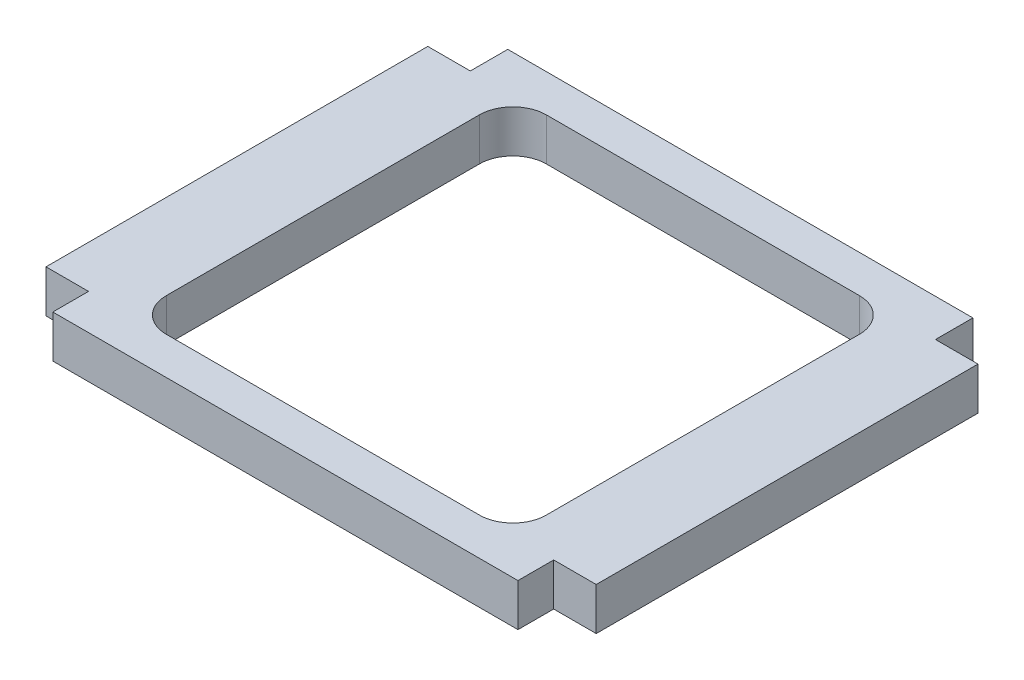
ISO-10303-21;
HEADER;
FILE_DESCRIPTION(('STEP AP214'),'2;1');
FILE_NAME('part.step','',(''),(''),'','','');
FILE_SCHEMA(('AUTOMOTIVE_DESIGN { 1 0 10303 214 1 1 1 1 }'));
ENDSEC;
DATA;
#1=APPLICATION_CONTEXT('core data for automotive mechanical design processes');
#2=APPLICATION_PROTOCOL_DEFINITION('international standard','automotive_design',2000,#1);
#3=PRODUCT_CONTEXT('',#1,'mechanical');
#4=PRODUCT('Part','Part','',(#3));
#5=PRODUCT_RELATED_PRODUCT_CATEGORY('part','',(#4));
#6=PRODUCT_DEFINITION_FORMATION('','',#4);
#7=PRODUCT_DEFINITION_CONTEXT('part definition',#1,'design');
#8=PRODUCT_DEFINITION('design','',#6,#7);
#9=PRODUCT_DEFINITION_SHAPE('','',#8);
#10=(LENGTH_UNIT() NAMED_UNIT(*) SI_UNIT(.MILLI.,.METRE.));
#11=(NAMED_UNIT(*) PLANE_ANGLE_UNIT() SI_UNIT($,.RADIAN.));
#12=(NAMED_UNIT(*) SI_UNIT($,.STERADIAN.) SOLID_ANGLE_UNIT());
#13=UNCERTAINTY_MEASURE_WITH_UNIT(LENGTH_MEASURE(1.E-05),#10,'distance_accuracy_value','');
#14=(GEOMETRIC_REPRESENTATION_CONTEXT(3) GLOBAL_UNCERTAINTY_ASSIGNED_CONTEXT((#13)) GLOBAL_UNIT_ASSIGNED_CONTEXT((#10,
#11,#12)) REPRESENTATION_CONTEXT('',''));
#15=CARTESIAN_POINT('',(0.,0.,0.));
#16=DIRECTION('',(0.,0.,1.));
#17=DIRECTION('',(1.,0.,0.));
#18=AXIS2_PLACEMENT_3D('',#15,#16,#17);
#19=CARTESIAN_POINT('',(0.,6.35,0.));
#20=DIRECTION('',(0.,-1.,0.));
#21=DIRECTION('',(0.,0.,-1.));
#22=AXIS2_PLACEMENT_3D('',#19,#20,#21);
#23=PLANE('',#22);
#24=DIRECTION('',(0.,0.,1.));
#25=VECTOR('',#24,1.);
#26=CARTESIAN_POINT('',(-34.7218,6.35,33.9598));
#27=LINE('',#26,#25);
#28=CARTESIAN_POINT('',(-34.7218,6.35,28.6282));
#29=VERTEX_POINT('',#28);
#30=CARTESIAN_POINT('',(-34.7218,6.35,33.9598));
#31=VERTEX_POINT('',#30);
#32=EDGE_CURVE('E234',#29,#31,#27,.T.);
#33=ORIENTED_EDGE('',*,*,#32,.T.);
#34=DIRECTION('',(1.,0.,0.));
#35=VECTOR('',#34,1.);
#36=CARTESIAN_POINT('',(-34.7218,6.35,33.9598));
#37=LINE('',#36,#35);
#38=CARTESIAN_POINT('',(34.7218,6.35,33.9598));
#39=VERTEX_POINT('',#38);
#40=EDGE_CURVE('E237',#31,#39,#37,.T.);
#41=ORIENTED_EDGE('',*,*,#40,.T.);
#42=DIRECTION('',(0.,0.,-1.));
#43=VECTOR('',#42,1.);
#44=CARTESIAN_POINT('',(34.7218,6.35,33.9598));
#45=LINE('',#44,#43);
#46=CARTESIAN_POINT('',(34.7218,6.35,28.6282));
#47=VERTEX_POINT('',#46);
#48=EDGE_CURVE('E240',#39,#47,#45,.T.);
#49=ORIENTED_EDGE('',*,*,#48,.T.);
#50=DIRECTION('',(1.,0.,0.));
#51=VECTOR('',#50,1.);
#52=CARTESIAN_POINT('',(41.0718,6.35,28.6282));
#53=LINE('',#52,#51);
#54=CARTESIAN_POINT('',(41.0718,6.35,28.6282));
#55=VERTEX_POINT('',#54);
#56=EDGE_CURVE('E242',#47,#55,#53,.T.);
#57=ORIENTED_EDGE('',*,*,#56,.T.);
#58=DIRECTION('',(0.,0.,-1.));
#59=VECTOR('',#58,1.);
#60=CARTESIAN_POINT('',(41.0718,6.35,28.6282));
#61=LINE('',#60,#59);
#62=CARTESIAN_POINT('',(41.0718,6.35,-28.3718));
#63=VERTEX_POINT('',#62);
#64=EDGE_CURVE('E244',#55,#63,#61,.T.);
#65=ORIENTED_EDGE('',*,*,#64,.T.);
#66=DIRECTION('',(-1.,0.,0.));
#67=VECTOR('',#66,1.);
#68=CARTESIAN_POINT('',(34.7218,6.35,-28.3718));
#69=LINE('',#68,#67);
#70=CARTESIAN_POINT('',(34.7218,6.35,-28.3718));
#71=VERTEX_POINT('',#70);
#72=EDGE_CURVE('E246',#63,#71,#69,.T.);
#73=ORIENTED_EDGE('',*,*,#72,.T.);
#74=DIRECTION('',(0.,0.,-1.));
#75=VECTOR('',#74,1.);
#76=CARTESIAN_POINT('',(34.7218,6.35,-28.3718));
#77=LINE('',#76,#75);
#78=CARTESIAN_POINT('',(34.7218,6.35,-33.9598));
#79=VERTEX_POINT('',#78);
#80=EDGE_CURVE('E248',#71,#79,#77,.T.);
#81=ORIENTED_EDGE('',*,*,#80,.T.);
#82=DIRECTION('',(-1.,0.,0.));
#83=VECTOR('',#82,1.);
#84=CARTESIAN_POINT('',(-34.7218,6.35,-33.9598));
#85=LINE('',#84,#83);
#86=CARTESIAN_POINT('',(-34.7218,6.35,-33.9598));
#87=VERTEX_POINT('',#86);
#88=EDGE_CURVE('E250',#79,#87,#85,.T.);
#89=ORIENTED_EDGE('',*,*,#88,.T.);
#90=DIRECTION('',(0.,0.,1.));
#91=VECTOR('',#90,1.);
#92=CARTESIAN_POINT('',(-34.7218,6.35,-28.3718));
#93=LINE('',#92,#91);
#94=CARTESIAN_POINT('',(-34.7218,6.35,-28.3718));
#95=VERTEX_POINT('',#94);
#96=EDGE_CURVE('E252',#87,#95,#93,.T.);
#97=ORIENTED_EDGE('',*,*,#96,.T.);
#98=DIRECTION('',(-1.,0.,0.));
#99=VECTOR('',#98,1.);
#100=CARTESIAN_POINT('',(-41.0718,6.35,-28.3718));
#101=LINE('',#100,#99);
#102=CARTESIAN_POINT('',(-41.0718,6.35,-28.3718));
#103=VERTEX_POINT('',#102);
#104=EDGE_CURVE('E254',#95,#103,#101,.T.);
#105=ORIENTED_EDGE('',*,*,#104,.T.);
#106=DIRECTION('',(0.,0.,1.));
#107=VECTOR('',#106,1.);
#108=CARTESIAN_POINT('',(-41.0718,6.35,28.6282));
#109=LINE('',#108,#107);
#110=CARTESIAN_POINT('',(-41.0718,6.35,28.6282));
#111=VERTEX_POINT('',#110);
#112=EDGE_CURVE('E256',#103,#111,#109,.T.);
#113=ORIENTED_EDGE('',*,*,#112,.T.);
#114=DIRECTION('',(1.,0.,0.));
#115=VECTOR('',#114,1.);
#116=CARTESIAN_POINT('',(-41.0718,6.35,28.6282));
#117=LINE('',#116,#115);
#118=EDGE_CURVE('E258',#111,#29,#117,.T.);
#119=ORIENTED_EDGE('',*,*,#118,.T.);
#120=EDGE_LOOP('',(#33,#41,#49,#57,#65,#73,#81,#89,#97,#105,#113,#119));
#121=FACE_BOUND('',#120,.T.);
#122=CARTESIAN_POINT('',(23.3718,6.35,-23.3718));
#123=DIRECTION('',(0.,1.,0.));
#124=DIRECTION('',(0.,0.,1.));
#125=AXIS2_PLACEMENT_3D('',#122,#123,#124);
#126=CIRCLE('',#125,5.);
#127=CARTESIAN_POINT('',(28.3718,6.35,-23.3718));
#128=VERTEX_POINT('',#127);
#129=CARTESIAN_POINT('',(23.3718,6.35,-28.3718));
#130=VERTEX_POINT('',#129);
#131=EDGE_CURVE('E169',#128,#130,#126,.T.);
#132=ORIENTED_EDGE('',*,*,#131,.F.);
#133=DIRECTION('',(0.,0.,-1.));
#134=VECTOR('',#133,1.);
#135=CARTESIAN_POINT('',(28.3718,6.35,23.3718));
#136=LINE('',#135,#134);
#137=CARTESIAN_POINT('',(28.3718,6.35,23.3718));
#138=VERTEX_POINT('',#137);
#139=EDGE_CURVE('E202',#138,#128,#136,.T.);
#140=ORIENTED_EDGE('',*,*,#139,.F.);
#141=CARTESIAN_POINT('',(23.3718,6.35,23.3718));
#142=DIRECTION('',(0.,1.,0.));
#143=DIRECTION('',(0.,0.,-1.));
#144=AXIS2_PLACEMENT_3D('',#141,#142,#143);
#145=CIRCLE('',#144,5.);
#146=CARTESIAN_POINT('',(23.3718,6.35,28.3718));
#147=VERTEX_POINT('',#146);
#148=EDGE_CURVE('E200',#147,#138,#145,.T.);
#149=ORIENTED_EDGE('',*,*,#148,.F.);
#150=DIRECTION('',(1.,0.,0.));
#151=VECTOR('',#150,1.);
#152=CARTESIAN_POINT('',(-23.3718,6.35,28.3718));
#153=LINE('',#152,#151);
#154=CARTESIAN_POINT('',(-23.3718,6.35,28.3718));
#155=VERTEX_POINT('',#154);
#156=EDGE_CURVE('E198',#155,#147,#153,.T.);
#157=ORIENTED_EDGE('',*,*,#156,.F.);
#158=CARTESIAN_POINT('',(-23.3718,6.35,23.3718));
#159=DIRECTION('',(0.,1.,0.));
#160=DIRECTION('',(0.,0.,-1.));
#161=AXIS2_PLACEMENT_3D('',#158,#159,#160);
#162=CIRCLE('',#161,5.);
#163=CARTESIAN_POINT('',(-28.3718,6.35,23.3718));
#164=VERTEX_POINT('',#163);
#165=EDGE_CURVE('E196',#164,#155,#162,.T.);
#166=ORIENTED_EDGE('',*,*,#165,.F.);
#167=DIRECTION('',(0.,0.,1.));
#168=VECTOR('',#167,1.);
#169=CARTESIAN_POINT('',(-28.3718,6.35,23.3718));
#170=LINE('',#169,#168);
#171=CARTESIAN_POINT('',(-28.3718,6.35,-23.3718));
#172=VERTEX_POINT('',#171);
#173=EDGE_CURVE('E192',#172,#164,#170,.T.);
#174=ORIENTED_EDGE('',*,*,#173,.F.);
#175=CARTESIAN_POINT('',(-23.3718,6.35,-23.3718));
#176=DIRECTION('',(0.,1.,0.));
#177=DIRECTION('',(0.,0.,-1.));
#178=AXIS2_PLACEMENT_3D('',#175,#176,#177);
#179=CIRCLE('',#178,5.);
#180=CARTESIAN_POINT('',(-23.3718,6.35,-28.3718));
#181=VERTEX_POINT('',#180);
#182=EDGE_CURVE('E190',#181,#172,#179,.T.);
#183=ORIENTED_EDGE('',*,*,#182,.F.);
#184=DIRECTION('',(-1.,0.,0.));
#185=VECTOR('',#184,1.);
#186=CARTESIAN_POINT('',(-23.3718,6.35,-28.3718));
#187=LINE('',#186,#185);
#188=EDGE_CURVE('E177',#130,#181,#187,.T.);
#189=ORIENTED_EDGE('',*,*,#188,.F.);
#190=EDGE_LOOP('',(#132,#140,#149,#157,#166,#174,#183,#189));
#191=FACE_BOUND('',#190,.T.);
#192=ADVANCED_FACE('F32',(#121,#191),#23,.F.);
#193=CARTESIAN_POINT('',(0.,0.,0.));
#194=DIRECTION('',(0.,-1.,0.));
#195=DIRECTION('',(0.,0.,-1.));
#196=AXIS2_PLACEMENT_3D('',#193,#194,#195);
#197=PLANE('',#196);
#198=DIRECTION('',(0.,0.,1.));
#199=VECTOR('',#198,1.);
#200=CARTESIAN_POINT('',(-34.7218,0.,33.9598));
#201=LINE('',#200,#199);
#202=CARTESIAN_POINT('',(-34.7218,0.,28.6282));
#203=VERTEX_POINT('',#202);
#204=CARTESIAN_POINT('',(-34.7218,0.,33.9598));
#205=VERTEX_POINT('',#204);
#206=EDGE_CURVE('E185',#203,#205,#201,.T.);
#207=ORIENTED_EDGE('',*,*,#206,.F.);
#208=DIRECTION('',(1.,0.,0.));
#209=VECTOR('',#208,1.);
#210=CARTESIAN_POINT('',(-41.0718,0.,28.6282));
#211=LINE('',#210,#209);
#212=CARTESIAN_POINT('',(-41.0718,0.,28.6282));
#213=VERTEX_POINT('',#212);
#214=EDGE_CURVE('E238',#213,#203,#211,.T.);
#215=ORIENTED_EDGE('',*,*,#214,.F.);
#216=DIRECTION('',(0.,0.,1.));
#217=VECTOR('',#216,1.);
#218=CARTESIAN_POINT('',(-41.0718,0.,28.6282));
#219=LINE('',#218,#217);
#220=CARTESIAN_POINT('',(-41.0718,0.,-28.3718));
#221=VERTEX_POINT('',#220);
#222=EDGE_CURVE('E281',#221,#213,#219,.T.);
#223=ORIENTED_EDGE('',*,*,#222,.F.);
#224=DIRECTION('',(-1.,0.,0.));
#225=VECTOR('',#224,1.);
#226=CARTESIAN_POINT('',(-41.0718,0.,-28.3718));
#227=LINE('',#226,#225);
#228=CARTESIAN_POINT('',(-34.7218,0.,-28.3718));
#229=VERTEX_POINT('',#228);
#230=EDGE_CURVE('E279',#229,#221,#227,.T.);
#231=ORIENTED_EDGE('',*,*,#230,.F.);
#232=DIRECTION('',(0.,0.,1.));
#233=VECTOR('',#232,1.);
#234=CARTESIAN_POINT('',(-34.7218,0.,-28.3718));
#235=LINE('',#234,#233);
#236=CARTESIAN_POINT('',(-34.7218,0.,-33.9598));
#237=VERTEX_POINT('',#236);
#238=EDGE_CURVE('E277',#237,#229,#235,.T.);
#239=ORIENTED_EDGE('',*,*,#238,.F.);
#240=DIRECTION('',(-1.,0.,0.));
#241=VECTOR('',#240,1.);
#242=CARTESIAN_POINT('',(-34.7218,0.,-33.9598));
#243=LINE('',#242,#241);
#244=CARTESIAN_POINT('',(34.7218,0.,-33.9598));
#245=VERTEX_POINT('',#244);
#246=EDGE_CURVE('E275',#245,#237,#243,.T.);
#247=ORIENTED_EDGE('',*,*,#246,.F.);
#248=DIRECTION('',(0.,0.,-1.));
#249=VECTOR('',#248,1.);
#250=CARTESIAN_POINT('',(34.7218,0.,-28.3718));
#251=LINE('',#250,#249);
#252=CARTESIAN_POINT('',(34.7218,0.,-28.3718));
#253=VERTEX_POINT('',#252);
#254=EDGE_CURVE('E273',#253,#245,#251,.T.);
#255=ORIENTED_EDGE('',*,*,#254,.F.);
#256=DIRECTION('',(-1.,0.,0.));
#257=VECTOR('',#256,1.);
#258=CARTESIAN_POINT('',(34.7218,0.,-28.3718));
#259=LINE('',#258,#257);
#260=CARTESIAN_POINT('',(41.0718,0.,-28.3718));
#261=VERTEX_POINT('',#260);
#262=EDGE_CURVE('E271',#261,#253,#259,.T.);
#263=ORIENTED_EDGE('',*,*,#262,.F.);
#264=DIRECTION('',(0.,0.,-1.));
#265=VECTOR('',#264,1.);
#266=CARTESIAN_POINT('',(41.0718,0.,28.6282));
#267=LINE('',#266,#265);
#268=CARTESIAN_POINT('',(41.0718,0.,28.6282));
#269=VERTEX_POINT('',#268);
#270=EDGE_CURVE('E269',#269,#261,#267,.T.);
#271=ORIENTED_EDGE('',*,*,#270,.F.);
#272=DIRECTION('',(1.,0.,0.));
#273=VECTOR('',#272,1.);
#274=CARTESIAN_POINT('',(41.0718,0.,28.6282));
#275=LINE('',#274,#273);
#276=CARTESIAN_POINT('',(34.7218,0.,28.6282));
#277=VERTEX_POINT('',#276);
#278=EDGE_CURVE('E267',#277,#269,#275,.T.);
#279=ORIENTED_EDGE('',*,*,#278,.F.);
#280=DIRECTION('',(0.,0.,-1.));
#281=VECTOR('',#280,1.);
#282=CARTESIAN_POINT('',(34.7218,0.,33.9598));
#283=LINE('',#282,#281);
#284=CARTESIAN_POINT('',(34.7218,0.,33.9598));
#285=VERTEX_POINT('',#284);
#286=EDGE_CURVE('E265',#285,#277,#283,.T.);
#287=ORIENTED_EDGE('',*,*,#286,.F.);
#288=DIRECTION('',(1.,0.,0.));
#289=VECTOR('',#288,1.);
#290=CARTESIAN_POINT('',(-34.7218,0.,33.9598));
#291=LINE('',#290,#289);
#292=EDGE_CURVE('E263',#205,#285,#291,.T.);
#293=ORIENTED_EDGE('',*,*,#292,.F.);
#294=EDGE_LOOP('',(#207,#215,#223,#231,#239,#247,#255,#263,#271,#279,#287,#293));
#295=FACE_BOUND('',#294,.T.);
#296=DIRECTION('',(0.,0.,-1.));
#297=VECTOR('',#296,1.);
#298=CARTESIAN_POINT('',(28.3718,0.,23.3718));
#299=LINE('',#298,#297);
#300=CARTESIAN_POINT('',(28.3718,0.,23.3718));
#301=VERTEX_POINT('',#300);
#302=CARTESIAN_POINT('',(28.3718,0.,-23.3718));
#303=VERTEX_POINT('',#302);
#304=EDGE_CURVE('E178',#301,#303,#299,.T.);
#305=ORIENTED_EDGE('',*,*,#304,.T.);
#306=CARTESIAN_POINT('',(23.3718,0.,-23.3718));
#307=DIRECTION('',(0.,1.,0.));
#308=DIRECTION('',(0.,0.,1.));
#309=AXIS2_PLACEMENT_3D('',#306,#307,#308);
#310=CIRCLE('',#309,5.);
#311=CARTESIAN_POINT('',(23.3718,0.,-28.3718));
#312=VERTEX_POINT('',#311);
#313=EDGE_CURVE('E55',#303,#312,#310,.T.);
#314=ORIENTED_EDGE('',*,*,#313,.T.);
#315=DIRECTION('',(-1.,0.,0.));
#316=VECTOR('',#315,1.);
#317=CARTESIAN_POINT('',(-23.3718,0.,-28.3718));
#318=LINE('',#317,#316);
#319=CARTESIAN_POINT('',(-23.3718,0.,-28.3718));
#320=VERTEX_POINT('',#319);
#321=EDGE_CURVE('E184',#312,#320,#318,.T.);
#322=ORIENTED_EDGE('',*,*,#321,.T.);
#323=CARTESIAN_POINT('',(-23.3718,0.,-23.3718));
#324=DIRECTION('',(0.,1.,0.));
#325=DIRECTION('',(0.,0.,-1.));
#326=AXIS2_PLACEMENT_3D('',#323,#324,#325);
#327=CIRCLE('',#326,5.);
#328=CARTESIAN_POINT('',(-28.3718,0.,-23.3718));
#329=VERTEX_POINT('',#328);
#330=EDGE_CURVE('E206',#320,#329,#327,.T.);
#331=ORIENTED_EDGE('',*,*,#330,.T.);
#332=DIRECTION('',(0.,0.,1.));
#333=VECTOR('',#332,1.);
#334=CARTESIAN_POINT('',(-28.3718,0.,23.3718));
#335=LINE('',#334,#333);
#336=CARTESIAN_POINT('',(-28.3718,0.,23.3718));
#337=VERTEX_POINT('',#336);
#338=EDGE_CURVE('E209',#329,#337,#335,.T.);
#339=ORIENTED_EDGE('',*,*,#338,.T.);
#340=CARTESIAN_POINT('',(-23.3718,0.,23.3718));
#341=DIRECTION('',(0.,1.,0.));
#342=DIRECTION('',(0.,0.,-1.));
#343=AXIS2_PLACEMENT_3D('',#340,#341,#342);
#344=CIRCLE('',#343,5.);
#345=CARTESIAN_POINT('',(-23.3718,0.,28.3718));
#346=VERTEX_POINT('',#345);
#347=EDGE_CURVE('E212',#337,#346,#344,.T.);
#348=ORIENTED_EDGE('',*,*,#347,.T.);
#349=DIRECTION('',(1.,0.,0.));
#350=VECTOR('',#349,1.);
#351=CARTESIAN_POINT('',(-23.3718,0.,28.3718));
#352=LINE('',#351,#350);
#353=CARTESIAN_POINT('',(23.3718,0.,28.3718));
#354=VERTEX_POINT('',#353);
#355=EDGE_CURVE('E215',#346,#354,#352,.T.);
#356=ORIENTED_EDGE('',*,*,#355,.T.);
#357=CARTESIAN_POINT('',(23.3718,0.,23.3718));
#358=DIRECTION('',(0.,1.,0.));
#359=DIRECTION('',(0.,0.,-1.));
#360=AXIS2_PLACEMENT_3D('',#357,#358,#359);
#361=CIRCLE('',#360,5.);
#362=EDGE_CURVE('E218',#354,#301,#361,.T.);
#363=ORIENTED_EDGE('',*,*,#362,.T.);
#364=EDGE_LOOP('',(#305,#314,#322,#331,#339,#348,#356,#363));
#365=FACE_BOUND('',#364,.T.);
#366=ADVANCED_FACE('F323',(#295,#365),#197,.T.);
#367=CARTESIAN_POINT('',(-34.7218,6.35,33.9598));
#368=DIRECTION('',(1.,0.,0.));
#369=DIRECTION('',(0.,0.,-1.));
#370=AXIS2_PLACEMENT_3D('',#367,#368,#369);
#371=PLANE('',#370);
#372=ORIENTED_EDGE('',*,*,#206,.T.);
#373=DIRECTION('',(0.,-1.,0.));
#374=VECTOR('',#373,1.);
#375=CARTESIAN_POINT('',(-34.7218,6.35,33.9598));
#376=LINE('',#375,#374);
#377=EDGE_CURVE('E11',#31,#205,#376,.T.);
#378=ORIENTED_EDGE('',*,*,#377,.F.);
#379=ORIENTED_EDGE('',*,*,#32,.F.);
#380=DIRECTION('',(0.,-1.,0.));
#381=VECTOR('',#380,1.);
#382=CARTESIAN_POINT('',(-34.7218,6.35,28.6282));
#383=LINE('',#382,#381);
#384=EDGE_CURVE('E260',#29,#203,#383,.T.);
#385=ORIENTED_EDGE('',*,*,#384,.T.);
#386=EDGE_LOOP('',(#372,#378,#379,#385));
#387=FACE_BOUND('',#386,.T.);
#388=ADVANCED_FACE('F34',(#387),#371,.F.);
#389=CARTESIAN_POINT('',(-34.7218,6.35,33.9598));
#390=DIRECTION('',(0.,0.,-1.));
#391=DIRECTION('',(-1.,0.,0.));
#392=AXIS2_PLACEMENT_3D('',#389,#390,#391);
#393=PLANE('',#392);
#394=ORIENTED_EDGE('',*,*,#292,.T.);
#395=DIRECTION('',(0.,-1.,0.));
#396=VECTOR('',#395,1.);
#397=CARTESIAN_POINT('',(34.7218,6.35,33.9598));
#398=LINE('',#397,#396);
#399=EDGE_CURVE('E40',#39,#285,#398,.T.);
#400=ORIENTED_EDGE('',*,*,#399,.F.);
#401=ORIENTED_EDGE('',*,*,#40,.F.);
#402=ORIENTED_EDGE('',*,*,#377,.T.);
#403=EDGE_LOOP('',(#394,#400,#401,#402));
#404=FACE_BOUND('',#403,.T.);
#405=ADVANCED_FACE('F340',(#404),#393,.F.);
#406=CARTESIAN_POINT('',(34.7218,6.35,33.9598));
#407=DIRECTION('',(-1.,0.,0.));
#408=DIRECTION('',(0.,0.,1.));
#409=AXIS2_PLACEMENT_3D('',#406,#407,#408);
#410=PLANE('',#409);
#411=ORIENTED_EDGE('',*,*,#286,.T.);
#412=DIRECTION('',(0.,-1.,0.));
#413=VECTOR('',#412,1.);
#414=CARTESIAN_POINT('',(34.7218,6.35,28.6282));
#415=LINE('',#414,#413);
#416=EDGE_CURVE('E310',#47,#277,#415,.T.);
#417=ORIENTED_EDGE('',*,*,#416,.F.);
#418=ORIENTED_EDGE('',*,*,#48,.F.);
#419=ORIENTED_EDGE('',*,*,#399,.T.);
#420=EDGE_LOOP('',(#411,#417,#418,#419));
#421=FACE_BOUND('',#420,.T.);
#422=ADVANCED_FACE('F317',(#421),#410,.F.);
#423=CARTESIAN_POINT('',(41.0718,6.35,28.6282));
#424=DIRECTION('',(0.,0.,-1.));
#425=DIRECTION('',(-1.,0.,0.));
#426=AXIS2_PLACEMENT_3D('',#423,#424,#425);
#427=PLANE('',#426);
#428=ORIENTED_EDGE('',*,*,#278,.T.);
#429=DIRECTION('',(0.,-1.,0.));
#430=VECTOR('',#429,1.);
#431=CARTESIAN_POINT('',(41.0718,6.35,28.6282));
#432=LINE('',#431,#430);
#433=EDGE_CURVE('E307',#55,#269,#432,.T.);
#434=ORIENTED_EDGE('',*,*,#433,.F.);
#435=ORIENTED_EDGE('',*,*,#56,.F.);
#436=ORIENTED_EDGE('',*,*,#416,.T.);
#437=EDGE_LOOP('',(#428,#434,#435,#436));
#438=FACE_BOUND('',#437,.T.);
#439=ADVANCED_FACE('F329',(#438),#427,.F.);
#440=CARTESIAN_POINT('',(41.0718,6.35,28.6282));
#441=DIRECTION('',(-1.,0.,0.));
#442=DIRECTION('',(0.,0.,1.));
#443=AXIS2_PLACEMENT_3D('',#440,#441,#442);
#444=PLANE('',#443);
#445=ORIENTED_EDGE('',*,*,#270,.T.);
#446=DIRECTION('',(0.,-1.,0.));
#447=VECTOR('',#446,1.);
#448=CARTESIAN_POINT('',(41.0718,6.35,-28.3718));
#449=LINE('',#448,#447);
#450=EDGE_CURVE('E304',#63,#261,#449,.T.);
#451=ORIENTED_EDGE('',*,*,#450,.F.);
#452=ORIENTED_EDGE('',*,*,#64,.F.);
#453=ORIENTED_EDGE('',*,*,#433,.T.);
#454=EDGE_LOOP('',(#445,#451,#452,#453));
#455=FACE_BOUND('',#454,.T.);
#456=ADVANCED_FACE('F333',(#455),#444,.F.);
#457=CARTESIAN_POINT('',(34.7218,6.35,-28.3718));
#458=DIRECTION('',(0.,0.,1.));
#459=DIRECTION('',(1.,0.,0.));
#460=AXIS2_PLACEMENT_3D('',#457,#458,#459);
#461=PLANE('',#460);
#462=ORIENTED_EDGE('',*,*,#262,.T.);
#463=DIRECTION('',(0.,-1.,0.));
#464=VECTOR('',#463,1.);
#465=CARTESIAN_POINT('',(34.7218,6.35,-28.3718));
#466=LINE('',#465,#464);
#467=EDGE_CURVE('E301',#71,#253,#466,.T.);
#468=ORIENTED_EDGE('',*,*,#467,.F.);
#469=ORIENTED_EDGE('',*,*,#72,.F.);
#470=ORIENTED_EDGE('',*,*,#450,.T.);
#471=EDGE_LOOP('',(#462,#468,#469,#470));
#472=FACE_BOUND('',#471,.T.);
#473=ADVANCED_FACE('F373',(#472),#461,.F.);
#474=CARTESIAN_POINT('',(34.7218,6.35,-28.3718));
#475=DIRECTION('',(-1.,0.,0.));
#476=DIRECTION('',(0.,0.,1.));
#477=AXIS2_PLACEMENT_3D('',#474,#475,#476);
#478=PLANE('',#477);
#479=ORIENTED_EDGE('',*,*,#254,.T.);
#480=DIRECTION('',(0.,-1.,0.));
#481=VECTOR('',#480,1.);
#482=CARTESIAN_POINT('',(34.7218,6.35,-33.9598));
#483=LINE('',#482,#481);
#484=EDGE_CURVE('E298',#79,#245,#483,.T.);
#485=ORIENTED_EDGE('',*,*,#484,.F.);
#486=ORIENTED_EDGE('',*,*,#80,.F.);
#487=ORIENTED_EDGE('',*,*,#467,.T.);
#488=EDGE_LOOP('',(#479,#485,#486,#487));
#489=FACE_BOUND('',#488,.T.);
#490=ADVANCED_FACE('F371',(#489),#478,.F.);
#491=CARTESIAN_POINT('',(-34.7218,6.35,-33.9598));
#492=DIRECTION('',(0.,0.,1.));
#493=DIRECTION('',(1.,0.,0.));
#494=AXIS2_PLACEMENT_3D('',#491,#492,#493);
#495=PLANE('',#494);
#496=ORIENTED_EDGE('',*,*,#246,.T.);
#497=DIRECTION('',(0.,-1.,0.));
#498=VECTOR('',#497,1.);
#499=CARTESIAN_POINT('',(-34.7218,6.35,-33.9598));
#500=LINE('',#499,#498);
#501=EDGE_CURVE('E295',#87,#237,#500,.T.);
#502=ORIENTED_EDGE('',*,*,#501,.F.);
#503=ORIENTED_EDGE('',*,*,#88,.F.);
#504=ORIENTED_EDGE('',*,*,#484,.T.);
#505=EDGE_LOOP('',(#496,#502,#503,#504));
#506=FACE_BOUND('',#505,.T.);
#507=ADVANCED_FACE('F367',(#506),#495,.F.);
#508=CARTESIAN_POINT('',(-34.7218,6.35,-28.3718));
#509=DIRECTION('',(1.,0.,0.));
#510=DIRECTION('',(0.,0.,-1.));
#511=AXIS2_PLACEMENT_3D('',#508,#509,#510);
#512=PLANE('',#511);
#513=ORIENTED_EDGE('',*,*,#238,.T.);
#514=DIRECTION('',(0.,-1.,0.));
#515=VECTOR('',#514,1.);
#516=CARTESIAN_POINT('',(-34.7218,6.35,-28.3718));
#517=LINE('',#516,#515);
#518=EDGE_CURVE('E292',#95,#229,#517,.T.);
#519=ORIENTED_EDGE('',*,*,#518,.F.);
#520=ORIENTED_EDGE('',*,*,#96,.F.);
#521=ORIENTED_EDGE('',*,*,#501,.T.);
#522=EDGE_LOOP('',(#513,#519,#520,#521));
#523=FACE_BOUND('',#522,.T.);
#524=ADVANCED_FACE('F362',(#523),#512,.F.);
#525=CARTESIAN_POINT('',(-41.0718,6.35,-28.3718));
#526=DIRECTION('',(0.,0.,1.));
#527=DIRECTION('',(1.,0.,0.));
#528=AXIS2_PLACEMENT_3D('',#525,#526,#527);
#529=PLANE('',#528);
#530=ORIENTED_EDGE('',*,*,#230,.T.);
#531=DIRECTION('',(0.,-1.,0.));
#532=VECTOR('',#531,1.);
#533=CARTESIAN_POINT('',(-41.0718,6.35,-28.3718));
#534=LINE('',#533,#532);
#535=EDGE_CURVE('E289',#103,#221,#534,.T.);
#536=ORIENTED_EDGE('',*,*,#535,.F.);
#537=ORIENTED_EDGE('',*,*,#104,.F.);
#538=ORIENTED_EDGE('',*,*,#518,.T.);
#539=EDGE_LOOP('',(#530,#536,#537,#538));
#540=FACE_BOUND('',#539,.T.);
#541=ADVANCED_FACE('F356',(#540),#529,.F.);
#542=CARTESIAN_POINT('',(-41.0718,6.35,28.6282));
#543=DIRECTION('',(1.,0.,0.));
#544=DIRECTION('',(0.,0.,-1.));
#545=AXIS2_PLACEMENT_3D('',#542,#543,#544);
#546=PLANE('',#545);
#547=ORIENTED_EDGE('',*,*,#222,.T.);
#548=DIRECTION('',(0.,-1.,0.));
#549=VECTOR('',#548,1.);
#550=CARTESIAN_POINT('',(-41.0718,6.35,28.6282));
#551=LINE('',#550,#549);
#552=EDGE_CURVE('E286',#111,#213,#551,.T.);
#553=ORIENTED_EDGE('',*,*,#552,.F.);
#554=ORIENTED_EDGE('',*,*,#112,.F.);
#555=ORIENTED_EDGE('',*,*,#535,.T.);
#556=EDGE_LOOP('',(#547,#553,#554,#555));
#557=FACE_BOUND('',#556,.T.);
#558=ADVANCED_FACE('F352',(#557),#546,.F.);
#559=CARTESIAN_POINT('',(-41.0718,6.35,28.6282));
#560=DIRECTION('',(0.,0.,-1.));
#561=DIRECTION('',(-1.,0.,0.));
#562=AXIS2_PLACEMENT_3D('',#559,#560,#561);
#563=PLANE('',#562);
#564=ORIENTED_EDGE('',*,*,#214,.T.);
#565=ORIENTED_EDGE('',*,*,#384,.F.);
#566=ORIENTED_EDGE('',*,*,#118,.F.);
#567=ORIENTED_EDGE('',*,*,#552,.T.);
#568=EDGE_LOOP('',(#564,#565,#566,#567));
#569=FACE_BOUND('',#568,.T.);
#570=ADVANCED_FACE('F347',(#569),#563,.F.);
#571=CARTESIAN_POINT('',(23.3718,6.35,-23.3718));
#572=DIRECTION('',(0.,-1.,0.));
#573=DIRECTION('',(0.,0.,-1.));
#574=AXIS2_PLACEMENT_3D('',#571,#572,#573);
#575=CYLINDRICAL_SURFACE('',#574,5.);
#576=ORIENTED_EDGE('',*,*,#313,.F.);
#577=DIRECTION('',(0.,-1.,0.));
#578=VECTOR('',#577,1.);
#579=CARTESIAN_POINT('',(28.3718,6.35,-23.3718));
#580=LINE('',#579,#578);
#581=EDGE_CURVE('E173',#128,#303,#580,.T.);
#582=ORIENTED_EDGE('',*,*,#581,.F.);
#583=ORIENTED_EDGE('',*,*,#131,.T.);
#584=DIRECTION('',(0.,-1.,0.));
#585=VECTOR('',#584,1.);
#586=CARTESIAN_POINT('',(23.3718,6.35,-28.3718));
#587=LINE('',#586,#585);
#588=EDGE_CURVE('E172',#130,#312,#587,.T.);
#589=ORIENTED_EDGE('',*,*,#588,.T.);
#590=EDGE_LOOP('',(#576,#582,#583,#589));
#591=FACE_BOUND('',#590,.T.);
#592=ADVANCED_FACE('F171',(#591),#575,.F.);
#593=CARTESIAN_POINT('',(-23.3718,6.35,-28.3718));
#594=DIRECTION('',(0.,0.,1.));
#595=DIRECTION('',(1.,0.,0.));
#596=AXIS2_PLACEMENT_3D('',#593,#594,#595);
#597=PLANE('',#596);
#598=ORIENTED_EDGE('',*,*,#321,.F.);
#599=ORIENTED_EDGE('',*,*,#588,.F.);
#600=ORIENTED_EDGE('',*,*,#188,.T.);
#601=DIRECTION('',(0.,-1.,0.));
#602=VECTOR('',#601,1.);
#603=CARTESIAN_POINT('',(-23.3718,6.35,-28.3718));
#604=LINE('',#603,#602);
#605=EDGE_CURVE('E186',#181,#320,#604,.T.);
#606=ORIENTED_EDGE('',*,*,#605,.T.);
#607=EDGE_LOOP('',(#598,#599,#600,#606));
#608=FACE_BOUND('',#607,.T.);
#609=ADVANCED_FACE('F181',(#608),#597,.T.);
#610=CARTESIAN_POINT('',(-23.3718,6.35,-23.3718));
#611=DIRECTION('',(0.,-1.,0.));
#612=DIRECTION('',(0.,0.,-1.));
#613=AXIS2_PLACEMENT_3D('',#610,#611,#612);
#614=CYLINDRICAL_SURFACE('',#613,5.);
#615=ORIENTED_EDGE('',*,*,#330,.F.);
#616=ORIENTED_EDGE('',*,*,#605,.F.);
#617=ORIENTED_EDGE('',*,*,#182,.T.);
#618=DIRECTION('',(0.,-1.,0.));
#619=VECTOR('',#618,1.);
#620=CARTESIAN_POINT('',(-28.3718,6.35,-23.3718));
#621=LINE('',#620,#619);
#622=EDGE_CURVE('E231',#172,#329,#621,.T.);
#623=ORIENTED_EDGE('',*,*,#622,.T.);
#624=EDGE_LOOP('',(#615,#616,#617,#623));
#625=FACE_BOUND('',#624,.T.);
#626=ADVANCED_FACE('F431',(#625),#614,.F.);
#627=CARTESIAN_POINT('',(-28.3718,6.35,23.3718));
#628=DIRECTION('',(1.,0.,0.));
#629=DIRECTION('',(0.,0.,-1.));
#630=AXIS2_PLACEMENT_3D('',#627,#628,#629);
#631=PLANE('',#630);
#632=ORIENTED_EDGE('',*,*,#338,.F.);
#633=ORIENTED_EDGE('',*,*,#622,.F.);
#634=ORIENTED_EDGE('',*,*,#173,.T.);
#635=DIRECTION('',(0.,-1.,0.));
#636=VECTOR('',#635,1.);
#637=CARTESIAN_POINT('',(-28.3718,6.35,23.3718));
#638=LINE('',#637,#636);
#639=EDGE_CURVE('E229',#164,#337,#638,.T.);
#640=ORIENTED_EDGE('',*,*,#639,.T.);
#641=EDGE_LOOP('',(#632,#633,#634,#640));
#642=FACE_BOUND('',#641,.T.);
#643=ADVANCED_FACE('F437',(#642),#631,.T.);
#644=CARTESIAN_POINT('',(-23.3718,6.35,23.3718));
#645=DIRECTION('',(0.,-1.,0.));
#646=DIRECTION('',(0.,0.,-1.));
#647=AXIS2_PLACEMENT_3D('',#644,#645,#646);
#648=CYLINDRICAL_SURFACE('',#647,5.);
#649=ORIENTED_EDGE('',*,*,#347,.F.);
#650=ORIENTED_EDGE('',*,*,#639,.F.);
#651=ORIENTED_EDGE('',*,*,#165,.T.);
#652=DIRECTION('',(0.,-1.,0.));
#653=VECTOR('',#652,1.);
#654=CARTESIAN_POINT('',(-23.3718,6.35,28.3718));
#655=LINE('',#654,#653);
#656=EDGE_CURVE('E227',#155,#346,#655,.T.);
#657=ORIENTED_EDGE('',*,*,#656,.T.);
#658=EDGE_LOOP('',(#649,#650,#651,#657));
#659=FACE_BOUND('',#658,.T.);
#660=ADVANCED_FACE('F445',(#659),#648,.F.);
#661=CARTESIAN_POINT('',(-23.3718,6.35,28.3718));
#662=DIRECTION('',(0.,0.,-1.));
#663=DIRECTION('',(-1.,0.,0.));
#664=AXIS2_PLACEMENT_3D('',#661,#662,#663);
#665=PLANE('',#664);
#666=ORIENTED_EDGE('',*,*,#355,.F.);
#667=ORIENTED_EDGE('',*,*,#656,.F.);
#668=ORIENTED_EDGE('',*,*,#156,.T.);
#669=DIRECTION('',(0.,-1.,0.));
#670=VECTOR('',#669,1.);
#671=CARTESIAN_POINT('',(23.3718,6.35,28.3718));
#672=LINE('',#671,#670);
#673=EDGE_CURVE('E225',#147,#354,#672,.T.);
#674=ORIENTED_EDGE('',*,*,#673,.T.);
#675=EDGE_LOOP('',(#666,#667,#668,#674));
#676=FACE_BOUND('',#675,.T.);
#677=ADVANCED_FACE('F453',(#676),#665,.T.);
#678=CARTESIAN_POINT('',(23.3718,6.35,23.3718));
#679=DIRECTION('',(0.,-1.,0.));
#680=DIRECTION('',(0.,0.,-1.));
#681=AXIS2_PLACEMENT_3D('',#678,#679,#680);
#682=CYLINDRICAL_SURFACE('',#681,5.);
#683=ORIENTED_EDGE('',*,*,#362,.F.);
#684=ORIENTED_EDGE('',*,*,#673,.F.);
#685=ORIENTED_EDGE('',*,*,#148,.T.);
#686=DIRECTION('',(0.,-1.,0.));
#687=VECTOR('',#686,1.);
#688=CARTESIAN_POINT('',(28.3718,6.35,23.3718));
#689=LINE('',#688,#687);
#690=EDGE_CURVE('E47',#138,#301,#689,.T.);
#691=ORIENTED_EDGE('',*,*,#690,.T.);
#692=EDGE_LOOP('',(#683,#684,#685,#691));
#693=FACE_BOUND('',#692,.T.);
#694=ADVANCED_FACE('F461',(#693),#682,.F.);
#695=CARTESIAN_POINT('',(28.3718,6.35,23.3718));
#696=DIRECTION('',(-1.,0.,0.));
#697=DIRECTION('',(0.,0.,1.));
#698=AXIS2_PLACEMENT_3D('',#695,#696,#697);
#699=PLANE('',#698);
#700=ORIENTED_EDGE('',*,*,#304,.F.);
#701=ORIENTED_EDGE('',*,*,#690,.F.);
#702=ORIENTED_EDGE('',*,*,#139,.T.);
#703=ORIENTED_EDGE('',*,*,#581,.T.);
#704=EDGE_LOOP('',(#700,#701,#702,#703));
#705=FACE_BOUND('',#704,.T.);
#706=ADVANCED_FACE('F469',(#705),#699,.T.);
#707=CLOSED_SHELL('',(#192,#366,#388,#405,#422,#439,#456,#473,#490,#507,#524,#541,#558,#570,
#592,#609,#626,#643,#660,#677,#694,#706));
#708=MANIFOLD_SOLID_BREP('B2',#707);
#709=ADVANCED_BREP_SHAPE_REPRESENTATION('',(#18,#708),#14);
#710=SHAPE_DEFINITION_REPRESENTATION(#9,#709);
ENDSEC;
END-ISO-10303-21;
